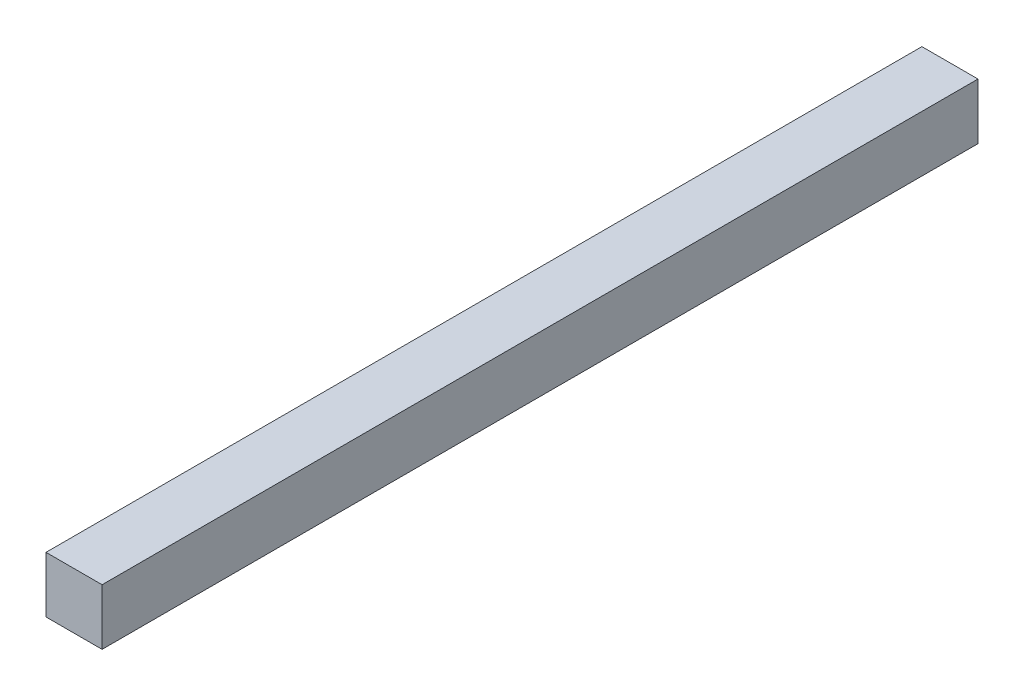
ISO-10303-21;
HEADER;
FILE_DESCRIPTION(('STEP AP214'),'2;1');
FILE_NAME('part.step','',(''),(''),'','','');
FILE_SCHEMA(('AUTOMOTIVE_DESIGN { 1 0 10303 214 1 1 1 1 }'));
ENDSEC;
DATA;
#1=APPLICATION_CONTEXT('core data for automotive mechanical design processes');
#2=APPLICATION_PROTOCOL_DEFINITION('international standard','automotive_design',2000,#1);
#3=PRODUCT_CONTEXT('',#1,'mechanical');
#4=PRODUCT('Part','Part','',(#3));
#5=PRODUCT_RELATED_PRODUCT_CATEGORY('part','',(#4));
#6=PRODUCT_DEFINITION_FORMATION('','',#4);
#7=PRODUCT_DEFINITION_CONTEXT('part definition',#1,'design');
#8=PRODUCT_DEFINITION('design','',#6,#7);
#9=PRODUCT_DEFINITION_SHAPE('','',#8);
#10=(LENGTH_UNIT() NAMED_UNIT(*) SI_UNIT(.MILLI.,.METRE.));
#11=(NAMED_UNIT(*) PLANE_ANGLE_UNIT() SI_UNIT($,.RADIAN.));
#12=(NAMED_UNIT(*) SI_UNIT($,.STERADIAN.) SOLID_ANGLE_UNIT());
#13=UNCERTAINTY_MEASURE_WITH_UNIT(LENGTH_MEASURE(1.E-05),#10,'distance_accuracy_value','');
#14=(GEOMETRIC_REPRESENTATION_CONTEXT(3) GLOBAL_UNCERTAINTY_ASSIGNED_CONTEXT((#13)) GLOBAL_UNIT_ASSIGNED_CONTEXT((#10,
#11,#12)) REPRESENTATION_CONTEXT('',''));
#15=CARTESIAN_POINT('',(0.,0.,0.));
#16=DIRECTION('',(0.,0.,1.));
#17=DIRECTION('',(1.,0.,0.));
#18=AXIS2_PLACEMENT_3D('',#15,#16,#17);
#19=CARTESIAN_POINT('',(-163.607460894573,4.19930494559834,-296.963372413229));
#20=DIRECTION('',(-1.,0.,0.));
#21=DIRECTION('',(0.,0.,1.));
#22=AXIS2_PLACEMENT_3D('',#19,#20,#21);
#23=PLANE('',#22);
#24=DIRECTION('',(0.,-1.,0.));
#25=VECTOR('',#24,1.);
#26=CARTESIAN_POINT('',(-163.607460894573,4.19930494559834,173.036627586771));
#27=LINE('',#26,#25);
#28=CARTESIAN_POINT('',(-163.607460894573,4.19930494559834,173.036627586771));
#29=VERTEX_POINT('',#28);
#30=CARTESIAN_POINT('',(-163.607460894573,-25.8462324957806,173.036627586771));
#31=VERTEX_POINT('',#30);
#32=EDGE_CURVE('E97',#29,#31,#27,.T.);
#33=ORIENTED_EDGE('',*,*,#32,.F.);
#34=DIRECTION('',(0.,0.,1.));
#35=VECTOR('',#34,1.);
#36=CARTESIAN_POINT('',(-163.607460894573,4.19930494559834,-296.963372413229));
#37=LINE('',#36,#35);
#38=CARTESIAN_POINT('',(-163.607460894573,4.19930494559834,-296.963372413229));
#39=VERTEX_POINT('',#38);
#40=EDGE_CURVE('E11',#39,#29,#37,.T.);
#41=ORIENTED_EDGE('',*,*,#40,.F.);
#42=DIRECTION('',(0.,-1.,0.));
#43=VECTOR('',#42,1.);
#44=CARTESIAN_POINT('',(-163.607460894573,4.19930494559834,-296.963372413229));
#45=LINE('',#44,#43);
#46=CARTESIAN_POINT('',(-163.607460894573,-25.8462324957806,-296.963372413229));
#47=VERTEX_POINT('',#46);
#48=EDGE_CURVE('E91',#39,#47,#45,.T.);
#49=ORIENTED_EDGE('',*,*,#48,.T.);
#50=DIRECTION('',(0.,0.,1.));
#51=VECTOR('',#50,1.);
#52=CARTESIAN_POINT('',(-163.607460894573,-25.8462324957806,-296.963372413229));
#53=LINE('',#52,#51);
#54=EDGE_CURVE('E36',#47,#31,#53,.T.);
#55=ORIENTED_EDGE('',*,*,#54,.T.);
#56=EDGE_LOOP('',(#33,#41,#49,#55));
#57=FACE_BOUND('',#56,.T.);
#58=ADVANCED_FACE('F33',(#57),#23,.T.);
#59=CARTESIAN_POINT('',(-163.607460894573,4.19930494559834,-296.963372413229));
#60=DIRECTION('',(0.,1.,0.));
#61=DIRECTION('',(0.,0.,1.));
#62=AXIS2_PLACEMENT_3D('',#59,#60,#61);
#63=PLANE('',#62);
#64=DIRECTION('',(-1.,0.,0.));
#65=VECTOR('',#64,1.);
#66=CARTESIAN_POINT('',(-163.607460894573,4.19930494559834,173.036627586771));
#67=LINE('',#66,#65);
#68=CARTESIAN_POINT('',(-133.505201999706,4.19930494559834,173.036627586771));
#69=VERTEX_POINT('',#68);
#70=EDGE_CURVE('E93',#69,#29,#67,.T.);
#71=ORIENTED_EDGE('',*,*,#70,.F.);
#72=DIRECTION('',(0.,0.,1.));
#73=VECTOR('',#72,1.);
#74=CARTESIAN_POINT('',(-133.505201999706,4.19930494559834,-296.963372413229));
#75=LINE('',#74,#73);
#76=CARTESIAN_POINT('',(-133.505201999706,4.19930494559834,-296.963372413229));
#77=VERTEX_POINT('',#76);
#78=EDGE_CURVE('E42',#77,#69,#75,.T.);
#79=ORIENTED_EDGE('',*,*,#78,.F.);
#80=DIRECTION('',(-1.,0.,0.));
#81=VECTOR('',#80,1.);
#82=CARTESIAN_POINT('',(-163.607460894573,4.19930494559834,-296.963372413229));
#83=LINE('',#82,#81);
#84=EDGE_CURVE('E88',#77,#39,#83,.T.);
#85=ORIENTED_EDGE('',*,*,#84,.T.);
#86=ORIENTED_EDGE('',*,*,#40,.T.);
#87=EDGE_LOOP('',(#71,#79,#85,#86));
#88=FACE_BOUND('',#87,.T.);
#89=ADVANCED_FACE('F107',(#88),#63,.T.);
#90=CARTESIAN_POINT('',(-133.505201999706,4.19930494559834,-296.963372413229));
#91=DIRECTION('',(1.,0.,0.));
#92=DIRECTION('',(0.,0.,-1.));
#93=AXIS2_PLACEMENT_3D('',#90,#91,#92);
#94=PLANE('',#93);
#95=DIRECTION('',(0.,1.,0.));
#96=VECTOR('',#95,1.);
#97=CARTESIAN_POINT('',(-133.505201999706,4.19930494559834,173.036627586771));
#98=LINE('',#97,#96);
#99=CARTESIAN_POINT('',(-133.505201999706,-25.8462324957806,173.036627586771));
#100=VERTEX_POINT('',#99);
#101=EDGE_CURVE('E83',#100,#69,#98,.T.);
#102=ORIENTED_EDGE('',*,*,#101,.F.);
#103=DIRECTION('',(0.,0.,1.));
#104=VECTOR('',#103,1.);
#105=CARTESIAN_POINT('',(-133.505201999706,-25.8462324957806,-296.963372413229));
#106=LINE('',#105,#104);
#107=CARTESIAN_POINT('',(-133.505201999706,-25.8462324957806,-296.963372413229));
#108=VERTEX_POINT('',#107);
#109=EDGE_CURVE('E78',#108,#100,#106,.T.);
#110=ORIENTED_EDGE('',*,*,#109,.F.);
#111=DIRECTION('',(0.,1.,0.));
#112=VECTOR('',#111,1.);
#113=CARTESIAN_POINT('',(-133.505201999706,4.19930494559834,-296.963372413229));
#114=LINE('',#113,#112);
#115=EDGE_CURVE('E81',#108,#77,#114,.T.);
#116=ORIENTED_EDGE('',*,*,#115,.T.);
#117=ORIENTED_EDGE('',*,*,#78,.T.);
#118=EDGE_LOOP('',(#102,#110,#116,#117));
#119=FACE_BOUND('',#118,.T.);
#120=ADVANCED_FACE('F80',(#119),#94,.T.);
#121=CARTESIAN_POINT('',(-163.607460894573,-25.8462324957806,-296.963372413229));
#122=DIRECTION('',(0.,-1.,0.));
#123=DIRECTION('',(0.,0.,-1.));
#124=AXIS2_PLACEMENT_3D('',#121,#122,#123);
#125=PLANE('',#124);
#126=DIRECTION('',(1.,0.,0.));
#127=VECTOR('',#126,1.);
#128=CARTESIAN_POINT('',(-163.607460894573,-25.8462324957806,173.036627586771));
#129=LINE('',#128,#127);
#130=EDGE_CURVE('E100',#31,#100,#129,.T.);
#131=ORIENTED_EDGE('',*,*,#130,.F.);
#132=ORIENTED_EDGE('',*,*,#54,.F.);
#133=DIRECTION('',(1.,0.,0.));
#134=VECTOR('',#133,1.);
#135=CARTESIAN_POINT('',(-163.607460894573,-25.8462324957806,-296.963372413229));
#136=LINE('',#135,#134);
#137=EDGE_CURVE('E87',#47,#108,#136,.T.);
#138=ORIENTED_EDGE('',*,*,#137,.T.);
#139=ORIENTED_EDGE('',*,*,#109,.T.);
#140=EDGE_LOOP('',(#131,#132,#138,#139));
#141=FACE_BOUND('',#140,.T.);
#142=ADVANCED_FACE('F90',(#141),#125,.T.);
#143=CARTESIAN_POINT('',(0.,0.,-296.963372413229));
#144=DIRECTION('',(0.,0.,1.));
#145=DIRECTION('',(1.,0.,0.));
#146=AXIS2_PLACEMENT_3D('',#143,#144,#145);
#147=PLANE('',#146);
#148=ORIENTED_EDGE('',*,*,#48,.F.);
#149=ORIENTED_EDGE('',*,*,#84,.F.);
#150=ORIENTED_EDGE('',*,*,#115,.F.);
#151=ORIENTED_EDGE('',*,*,#137,.F.);
#152=EDGE_LOOP('',(#148,#149,#150,#151));
#153=FACE_BOUND('',#152,.T.);
#154=ADVANCED_FACE('F86',(#153),#147,.F.);
#155=CARTESIAN_POINT('',(0.,0.,173.036627586771));
#156=DIRECTION('',(0.,0.,1.));
#157=DIRECTION('',(1.,0.,0.));
#158=AXIS2_PLACEMENT_3D('',#155,#156,#157);
#159=PLANE('',#158);
#160=ORIENTED_EDGE('',*,*,#32,.T.);
#161=ORIENTED_EDGE('',*,*,#130,.T.);
#162=ORIENTED_EDGE('',*,*,#101,.T.);
#163=ORIENTED_EDGE('',*,*,#70,.T.);
#164=EDGE_LOOP('',(#160,#161,#162,#163));
#165=FACE_BOUND('',#164,.T.);
#166=ADVANCED_FACE('F106',(#165),#159,.T.);
#167=CLOSED_SHELL('',(#58,#89,#120,#142,#154,#166));
#168=MANIFOLD_SOLID_BREP('B2',#167);
#169=ADVANCED_BREP_SHAPE_REPRESENTATION('',(#18,#168),#14);
#170=SHAPE_DEFINITION_REPRESENTATION(#9,#169);
ENDSEC;
END-ISO-10303-21;
